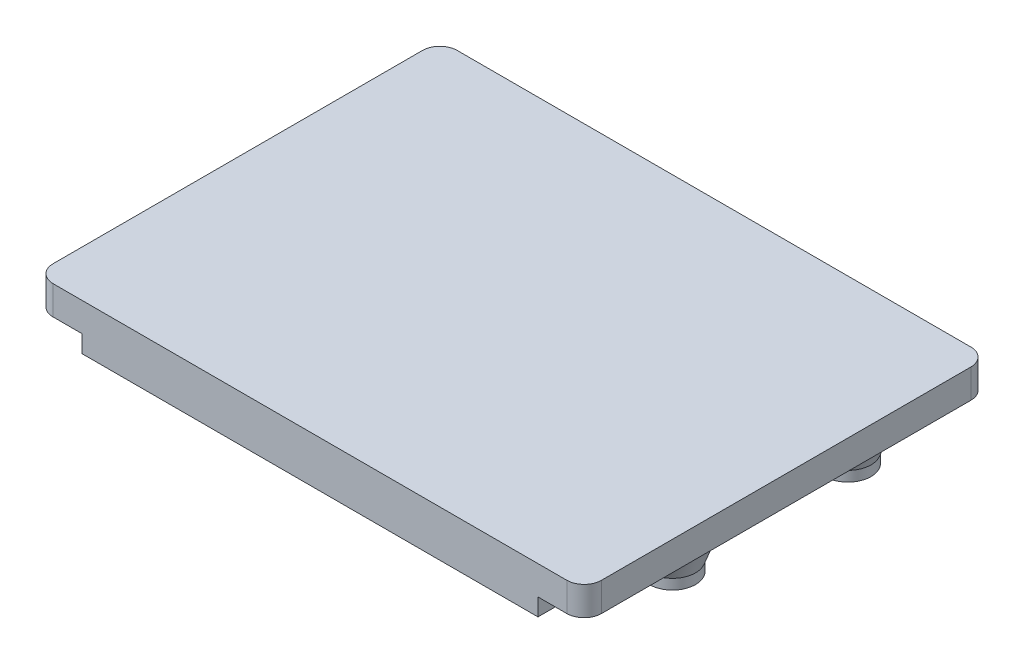
ISO-10303-21;
HEADER;
FILE_DESCRIPTION(('STEP AP214'),'2;1');
FILE_NAME('part.step','',(''),(''),'','','');
FILE_SCHEMA(('AUTOMOTIVE_DESIGN { 1 0 10303 214 1 1 1 1 }'));
ENDSEC;
DATA;
#1=APPLICATION_CONTEXT('core data for automotive mechanical design processes');
#2=APPLICATION_PROTOCOL_DEFINITION('international standard','automotive_design',2000,#1);
#3=PRODUCT_CONTEXT('',#1,'mechanical');
#4=PRODUCT('Part','Part','',(#3));
#5=PRODUCT_RELATED_PRODUCT_CATEGORY('part','',(#4));
#6=PRODUCT_DEFINITION_FORMATION('','',#4);
#7=PRODUCT_DEFINITION_CONTEXT('part definition',#1,'design');
#8=PRODUCT_DEFINITION('design','',#6,#7);
#9=PRODUCT_DEFINITION_SHAPE('','',#8);
#10=(LENGTH_UNIT() NAMED_UNIT(*) SI_UNIT(.MILLI.,.METRE.));
#11=(NAMED_UNIT(*) PLANE_ANGLE_UNIT() SI_UNIT($,.RADIAN.));
#12=(NAMED_UNIT(*) SI_UNIT($,.STERADIAN.) SOLID_ANGLE_UNIT());
#13=UNCERTAINTY_MEASURE_WITH_UNIT(LENGTH_MEASURE(1.E-05),#10,'distance_accuracy_value','');
#14=(GEOMETRIC_REPRESENTATION_CONTEXT(3) GLOBAL_UNCERTAINTY_ASSIGNED_CONTEXT((#13)) GLOBAL_UNIT_ASSIGNED_CONTEXT((#10,
#11,#12)) REPRESENTATION_CONTEXT('',''));
#15=CARTESIAN_POINT('',(0.,0.,0.));
#16=DIRECTION('',(0.,0.,1.));
#17=DIRECTION('',(1.,0.,0.));
#18=AXIS2_PLACEMENT_3D('',#15,#16,#17);
#19=CARTESIAN_POINT('',(-47.5,0.,35.));
#20=DIRECTION('',(0.,1.,0.));
#21=DIRECTION('',(0.,0.,1.));
#22=AXIS2_PLACEMENT_3D('',#19,#20,#21);
#23=PLANE('',#22);
#24=CARTESIAN_POINT('',(-25.5,0.,10.5));
#25=DIRECTION('',(0.,1.,0.));
#26=DIRECTION('',(0.,0.,1.));
#27=AXIS2_PLACEMENT_3D('',#24,#25,#26);
#28=CIRCLE('',#27,7.);
#29=CARTESIAN_POINT('',(-25.5,0.,17.5));
#30=VERTEX_POINT('',#29);
#31=EDGE_CURVE('E403',#30,#30,#28,.T.);
#32=ORIENTED_EDGE('',*,*,#31,.T.);
#33=EDGE_LOOP('',(#32));
#34=FACE_BOUND('',#33,.T.);
#35=CARTESIAN_POINT('',(-36.5,0.,-23.5));
#36=DIRECTION('',(0.,1.,0.));
#37=DIRECTION('',(0.,0.,1.));
#38=AXIS2_PLACEMENT_3D('',#35,#36,#37);
#39=CIRCLE('',#38,7.);
#40=CARTESIAN_POINT('',(-36.5,0.,-16.5));
#41=VERTEX_POINT('',#40);
#42=EDGE_CURVE('E400',#41,#41,#39,.T.);
#43=ORIENTED_EDGE('',*,*,#42,.T.);
#44=EDGE_LOOP('',(#43));
#45=FACE_BOUND('',#44,.T.);
#46=CARTESIAN_POINT('',(36.3,0.,-21.9));
#47=DIRECTION('',(0.,1.,0.));
#48=DIRECTION('',(0.,0.,1.));
#49=AXIS2_PLACEMENT_3D('',#46,#47,#48);
#50=CIRCLE('',#49,7.);
#51=CARTESIAN_POINT('',(36.3,0.,-14.9));
#52=VERTEX_POINT('',#51);
#53=EDGE_CURVE('E397',#52,#52,#50,.T.);
#54=ORIENTED_EDGE('',*,*,#53,.T.);
#55=EDGE_LOOP('',(#54));
#56=FACE_BOUND('',#55,.T.);
#57=CARTESIAN_POINT('',(37.3,0.,9.50000000000001));
#58=DIRECTION('',(0.,1.,0.));
#59=DIRECTION('',(0.,0.,1.));
#60=AXIS2_PLACEMENT_3D('',#57,#58,#59);
#61=CIRCLE('',#60,7.);
#62=CARTESIAN_POINT('',(37.3,0.,16.5));
#63=VERTEX_POINT('',#62);
#64=EDGE_CURVE('E394',#63,#63,#61,.T.);
#65=ORIENTED_EDGE('',*,*,#64,.T.);
#66=EDGE_LOOP('',(#65));
#67=FACE_BOUND('',#66,.T.);
#68=DIRECTION('',(-1.,0.,0.));
#69=VECTOR('',#68,1.);
#70=CARTESIAN_POINT('',(-47.5,0.,-35.));
#71=LINE('',#70,#69);
#72=CARTESIAN_POINT('',(44.5,0.,-35.));
#73=VERTEX_POINT('',#72);
#74=CARTESIAN_POINT('',(29.5,0.,-35.));
#75=VERTEX_POINT('',#74);
#76=EDGE_CURVE('E331',#73,#75,#71,.T.);
#77=ORIENTED_EDGE('',*,*,#76,.F.);
#78=CARTESIAN_POINT('',(44.5,0.,-32.));
#79=DIRECTION('',(0.,1.,0.));
#80=DIRECTION('',(0.,0.,1.));
#81=AXIS2_PLACEMENT_3D('',#78,#79,#80);
#82=CIRCLE('',#81,3.);
#83=CARTESIAN_POINT('',(47.5,0.,-32.));
#84=VERTEX_POINT('',#83);
#85=EDGE_CURVE('E539',#73,#84,#82,.F.);
#86=ORIENTED_EDGE('',*,*,#85,.T.);
#87=DIRECTION('',(0.,0.,-1.));
#88=VECTOR('',#87,1.);
#89=CARTESIAN_POINT('',(47.5,0.,-35.));
#90=LINE('',#89,#88);
#91=CARTESIAN_POINT('',(47.5,0.,32.));
#92=VERTEX_POINT('',#91);
#93=EDGE_CURVE('E319',#92,#84,#90,.T.);
#94=ORIENTED_EDGE('',*,*,#93,.F.);
#95=CARTESIAN_POINT('',(44.5,0.,32.));
#96=DIRECTION('',(0.,1.,0.));
#97=DIRECTION('',(0.,0.,1.));
#98=AXIS2_PLACEMENT_3D('',#95,#96,#97);
#99=CIRCLE('',#98,3.);
#100=CARTESIAN_POINT('',(44.5,0.,35.));
#101=VERTEX_POINT('',#100);
#102=EDGE_CURVE('E315',#92,#101,#99,.F.);
#103=ORIENTED_EDGE('',*,*,#102,.T.);
#104=DIRECTION('',(1.,0.,0.));
#105=VECTOR('',#104,1.);
#106=CARTESIAN_POINT('',(-47.5,0.,35.));
#107=LINE('',#106,#105);
#108=CARTESIAN_POINT('',(39.5,0.,35.));
#109=VERTEX_POINT('',#108);
#110=EDGE_CURVE('E320',#109,#101,#107,.T.);
#111=ORIENTED_EDGE('',*,*,#110,.F.);
#112=DIRECTION('',(0.,0.,1.));
#113=VECTOR('',#112,1.);
#114=CARTESIAN_POINT('',(39.5,0.,35.));
#115=LINE('',#114,#113);
#116=CARTESIAN_POINT('',(39.5,0.,30.));
#117=VERTEX_POINT('',#116);
#118=EDGE_CURVE('E284',#117,#109,#115,.T.);
#119=ORIENTED_EDGE('',*,*,#118,.F.);
#120=DIRECTION('',(1.,0.,0.));
#121=VECTOR('',#120,1.);
#122=CARTESIAN_POINT('',(-39.5,0.,30.));
#123=LINE('',#122,#121);
#124=CARTESIAN_POINT('',(-39.5,0.,30.));
#125=VERTEX_POINT('',#124);
#126=EDGE_CURVE('E291',#125,#117,#123,.T.);
#127=ORIENTED_EDGE('',*,*,#126,.F.);
#128=DIRECTION('',(0.,0.,-1.));
#129=VECTOR('',#128,1.);
#130=CARTESIAN_POINT('',(-39.5,0.,35.));
#131=LINE('',#130,#129);
#132=CARTESIAN_POINT('',(-39.5,0.,35.));
#133=VERTEX_POINT('',#132);
#134=EDGE_CURVE('E279',#133,#125,#131,.T.);
#135=ORIENTED_EDGE('',*,*,#134,.F.);
#136=CARTESIAN_POINT('',(-44.5,0.,35.));
#137=VERTEX_POINT('',#136);
#138=EDGE_CURVE('E316',#137,#133,#107,.T.);
#139=ORIENTED_EDGE('',*,*,#138,.F.);
#140=CARTESIAN_POINT('',(-44.5,0.,32.));
#141=DIRECTION('',(0.,1.,0.));
#142=DIRECTION('',(0.,0.,1.));
#143=AXIS2_PLACEMENT_3D('',#140,#141,#142);
#144=CIRCLE('',#143,3.);
#145=CARTESIAN_POINT('',(-47.5,0.,32.));
#146=VERTEX_POINT('',#145);
#147=EDGE_CURVE('E534',#137,#146,#144,.F.);
#148=ORIENTED_EDGE('',*,*,#147,.T.);
#149=DIRECTION('',(0.,0.,1.));
#150=VECTOR('',#149,1.);
#151=CARTESIAN_POINT('',(-47.5,0.,-35.));
#152=LINE('',#151,#150);
#153=CARTESIAN_POINT('',(-47.5,0.,9.49999999999999));
#154=VERTEX_POINT('',#153);
#155=EDGE_CURVE('E356',#154,#146,#152,.T.);
#156=ORIENTED_EDGE('',*,*,#155,.F.);
#157=DIRECTION('',(-1.,0.,0.));
#158=VECTOR('',#157,1.);
#159=CARTESIAN_POINT('',(-47.5,0.,9.49999999999999));
#160=LINE('',#159,#158);
#161=CARTESIAN_POINT('',(-42.5,0.,9.49999999999999));
#162=VERTEX_POINT('',#161);
#163=EDGE_CURVE('E213',#162,#154,#160,.T.);
#164=ORIENTED_EDGE('',*,*,#163,.F.);
#165=DIRECTION('',(0.,0.,1.));
#166=VECTOR('',#165,1.);
#167=CARTESIAN_POINT('',(-42.5,0.,9.49999999999999));
#168=LINE('',#167,#166);
#169=CARTESIAN_POINT('',(-42.5,0.,0.499999999999995));
#170=VERTEX_POINT('',#169);
#171=EDGE_CURVE('E522',#170,#162,#168,.T.);
#172=ORIENTED_EDGE('',*,*,#171,.F.);
#173=DIRECTION('',(1.,0.,0.));
#174=VECTOR('',#173,1.);
#175=CARTESIAN_POINT('',(-47.5,0.,0.499999999999995));
#176=LINE('',#175,#174);
#177=CARTESIAN_POINT('',(-47.5,0.,0.499999999999995));
#178=VERTEX_POINT('',#177);
#179=EDGE_CURVE('E516',#178,#170,#176,.T.);
#180=ORIENTED_EDGE('',*,*,#179,.F.);
#181=CARTESIAN_POINT('',(-47.5,0.,-5.50000000000001));
#182=VERTEX_POINT('',#181);
#183=EDGE_CURVE('E219',#182,#178,#152,.T.);
#184=ORIENTED_EDGE('',*,*,#183,.F.);
#185=DIRECTION('',(-1.,0.,0.));
#186=VECTOR('',#185,1.);
#187=CARTESIAN_POINT('',(-47.5,0.,-5.50000000000001));
#188=LINE('',#187,#186);
#189=CARTESIAN_POINT('',(-42.5,0.,-5.50000000000001));
#190=VERTEX_POINT('',#189);
#191=EDGE_CURVE('E232',#190,#182,#188,.T.);
#192=ORIENTED_EDGE('',*,*,#191,.F.);
#193=DIRECTION('',(0.,0.,1.));
#194=VECTOR('',#193,1.);
#195=CARTESIAN_POINT('',(-42.5,0.,-5.50000000000001));
#196=LINE('',#195,#194);
#197=CARTESIAN_POINT('',(-42.5,0.,-14.5));
#198=VERTEX_POINT('',#197);
#199=EDGE_CURVE('E222',#198,#190,#196,.T.);
#200=ORIENTED_EDGE('',*,*,#199,.F.);
#201=DIRECTION('',(1.,0.,0.));
#202=VECTOR('',#201,1.);
#203=CARTESIAN_POINT('',(-47.5,0.,-14.5));
#204=LINE('',#203,#202);
#205=CARTESIAN_POINT('',(-47.5,0.,-14.5));
#206=VERTEX_POINT('',#205);
#207=EDGE_CURVE('E220',#206,#198,#204,.T.);
#208=ORIENTED_EDGE('',*,*,#207,.F.);
#209=CARTESIAN_POINT('',(-47.5,0.,-32.));
#210=VERTEX_POINT('',#209);
#211=EDGE_CURVE('E325',#210,#206,#152,.T.);
#212=ORIENTED_EDGE('',*,*,#211,.F.);
#213=CARTESIAN_POINT('',(-44.5,0.,-32.));
#214=DIRECTION('',(0.,1.,0.));
#215=DIRECTION('',(0.,0.,1.));
#216=AXIS2_PLACEMENT_3D('',#213,#214,#215);
#217=CIRCLE('',#216,3.);
#218=CARTESIAN_POINT('',(-44.5,0.,-35.));
#219=VERTEX_POINT('',#218);
#220=EDGE_CURVE('E538',#210,#219,#217,.F.);
#221=ORIENTED_EDGE('',*,*,#220,.T.);
#222=CARTESIAN_POINT('',(-28.5,0.,-35.));
#223=VERTEX_POINT('',#222);
#224=EDGE_CURVE('E673',#223,#219,#71,.T.);
#225=ORIENTED_EDGE('',*,*,#224,.F.);
#226=DIRECTION('',(0.,0.,-1.));
#227=VECTOR('',#226,1.);
#228=CARTESIAN_POINT('',(-28.5,0.,-30.));
#229=LINE('',#228,#227);
#230=CARTESIAN_POINT('',(-28.5,0.,-30.));
#231=VERTEX_POINT('',#230);
#232=EDGE_CURVE('E252',#231,#223,#229,.T.);
#233=ORIENTED_EDGE('',*,*,#232,.F.);
#234=DIRECTION('',(-1.,0.,0.));
#235=VECTOR('',#234,1.);
#236=CARTESIAN_POINT('',(-28.5,0.,-30.));
#237=LINE('',#236,#235);
#238=CARTESIAN_POINT('',(29.5,0.,-30.));
#239=VERTEX_POINT('',#238);
#240=EDGE_CURVE('E257',#239,#231,#237,.T.);
#241=ORIENTED_EDGE('',*,*,#240,.F.);
#242=DIRECTION('',(0.,0.,1.));
#243=VECTOR('',#242,1.);
#244=CARTESIAN_POINT('',(29.5,0.,-30.));
#245=LINE('',#244,#243);
#246=EDGE_CURVE('E265',#75,#239,#245,.T.);
#247=ORIENTED_EDGE('',*,*,#246,.F.);
#248=EDGE_LOOP('',(#77,#86,#94,#103,#111,#119,#127,#135,#139,#148,#156,#164,#172,#180,#184,#192,
#200,#208,#212,#221,#225,#233,#241,#247));
#249=FACE_BOUND('',#248,.T.);
#250=ADVANCED_FACE('F32',(#34,#45,#56,#67,#249),#23,.F.);
#251=CARTESIAN_POINT('',(-47.5,5.,-35.));
#252=DIRECTION('',(1.,0.,0.));
#253=DIRECTION('',(0.,0.,-1.));
#254=AXIS2_PLACEMENT_3D('',#251,#252,#253);
#255=PLANE('',#254);
#256=DIRECTION('',(0.,0.,1.));
#257=VECTOR('',#256,1.);
#258=CARTESIAN_POINT('',(-47.5,5.,-35.));
#259=LINE('',#258,#257);
#260=CARTESIAN_POINT('',(-47.5,5.,-32.));
#261=VERTEX_POINT('',#260);
#262=CARTESIAN_POINT('',(-47.5,5.,32.));
#263=VERTEX_POINT('',#262);
#264=EDGE_CURVE('E359',#261,#263,#259,.T.);
#265=ORIENTED_EDGE('',*,*,#264,.F.);
#266=DIRECTION('',(0.,-1.,0.));
#267=VECTOR('',#266,1.);
#268=CARTESIAN_POINT('',(-47.5,5.,-32.));
#269=LINE('',#268,#267);
#270=EDGE_CURVE('E379',#261,#210,#269,.T.);
#271=ORIENTED_EDGE('',*,*,#270,.T.);
#272=ORIENTED_EDGE('',*,*,#211,.T.);
#273=DIRECTION('',(0.,1.,0.));
#274=VECTOR('',#273,1.);
#275=CARTESIAN_POINT('',(-47.5,-3.,-14.5));
#276=LINE('',#275,#274);
#277=CARTESIAN_POINT('',(-47.5,-3.,-14.5));
#278=VERTEX_POINT('',#277);
#279=EDGE_CURVE('E249',#278,#206,#276,.T.);
#280=ORIENTED_EDGE('',*,*,#279,.F.);
#281=DIRECTION('',(0.,0.,-1.));
#282=VECTOR('',#281,1.);
#283=CARTESIAN_POINT('',(-47.5,-3.,-5.50000000000001));
#284=LINE('',#283,#282);
#285=CARTESIAN_POINT('',(-47.5,-3.,-5.50000000000001));
#286=VERTEX_POINT('',#285);
#287=EDGE_CURVE('E228',#286,#278,#284,.T.);
#288=ORIENTED_EDGE('',*,*,#287,.F.);
#289=DIRECTION('',(0.,1.,0.));
#290=VECTOR('',#289,1.);
#291=CARTESIAN_POINT('',(-47.5,-3.,-5.50000000000001));
#292=LINE('',#291,#290);
#293=EDGE_CURVE('E237',#286,#182,#292,.T.);
#294=ORIENTED_EDGE('',*,*,#293,.T.);
#295=ORIENTED_EDGE('',*,*,#183,.T.);
#296=DIRECTION('',(0.,1.,0.));
#297=VECTOR('',#296,1.);
#298=CARTESIAN_POINT('',(-47.5,-5.,0.499999999999995));
#299=LINE('',#298,#297);
#300=CARTESIAN_POINT('',(-47.5,-5.,0.499999999999995));
#301=VERTEX_POINT('',#300);
#302=EDGE_CURVE('E198',#301,#178,#299,.T.);
#303=ORIENTED_EDGE('',*,*,#302,.F.);
#304=DIRECTION('',(0.,0.,-1.));
#305=VECTOR('',#304,1.);
#306=CARTESIAN_POINT('',(-47.5,-5.,9.49999999999999));
#307=LINE('',#306,#305);
#308=CARTESIAN_POINT('',(-47.5,-5.,9.49999999999999));
#309=VERTEX_POINT('',#308);
#310=EDGE_CURVE('E205',#309,#301,#307,.T.);
#311=ORIENTED_EDGE('',*,*,#310,.F.);
#312=DIRECTION('',(0.,1.,0.));
#313=VECTOR('',#312,1.);
#314=CARTESIAN_POINT('',(-47.5,-5.,9.49999999999999));
#315=LINE('',#314,#313);
#316=EDGE_CURVE('E520',#309,#154,#315,.T.);
#317=ORIENTED_EDGE('',*,*,#316,.T.);
#318=ORIENTED_EDGE('',*,*,#155,.T.);
#319=DIRECTION('',(0.,-1.,0.));
#320=VECTOR('',#319,1.);
#321=CARTESIAN_POINT('',(-47.5,5.,32.));
#322=LINE('',#321,#320);
#323=EDGE_CURVE('E381',#146,#263,#322,.F.);
#324=ORIENTED_EDGE('',*,*,#323,.T.);
#325=EDGE_LOOP('',(#265,#271,#272,#280,#288,#294,#295,#303,#311,#317,#318,#324));
#326=FACE_BOUND('',#325,.T.);
#327=ADVANCED_FACE('F217',(#326),#255,.F.);
#328=CARTESIAN_POINT('',(-47.5,5.,35.));
#329=DIRECTION('',(0.,0.,-1.));
#330=DIRECTION('',(-1.,0.,0.));
#331=AXIS2_PLACEMENT_3D('',#328,#329,#330);
#332=PLANE('',#331);
#333=DIRECTION('',(1.,0.,0.));
#334=VECTOR('',#333,1.);
#335=CARTESIAN_POINT('',(-47.5,5.,35.));
#336=LINE('',#335,#334);
#337=CARTESIAN_POINT('',(-44.5,5.,35.));
#338=VERTEX_POINT('',#337);
#339=CARTESIAN_POINT('',(44.5,5.,35.));
#340=VERTEX_POINT('',#339);
#341=EDGE_CURVE('E361',#338,#340,#336,.T.);
#342=ORIENTED_EDGE('',*,*,#341,.F.);
#343=DIRECTION('',(0.,-1.,0.));
#344=VECTOR('',#343,1.);
#345=CARTESIAN_POINT('',(-44.5,5.,35.));
#346=LINE('',#345,#344);
#347=EDGE_CURVE('E347',#338,#137,#346,.T.);
#348=ORIENTED_EDGE('',*,*,#347,.T.);
#349=ORIENTED_EDGE('',*,*,#138,.T.);
#350=DIRECTION('',(0.,1.,0.));
#351=VECTOR('',#350,1.);
#352=CARTESIAN_POINT('',(-39.5,-3.,35.));
#353=LINE('',#352,#351);
#354=CARTESIAN_POINT('',(-39.5,-3.,35.));
#355=VERTEX_POINT('',#354);
#356=EDGE_CURVE('E290',#355,#133,#353,.T.);
#357=ORIENTED_EDGE('',*,*,#356,.F.);
#358=DIRECTION('',(-1.,0.,0.));
#359=VECTOR('',#358,1.);
#360=CARTESIAN_POINT('',(-39.5,-3.,35.));
#361=LINE('',#360,#359);
#362=CARTESIAN_POINT('',(39.5,-3.,35.));
#363=VERTEX_POINT('',#362);
#364=EDGE_CURVE('E288',#363,#355,#361,.T.);
#365=ORIENTED_EDGE('',*,*,#364,.F.);
#366=DIRECTION('',(0.,1.,0.));
#367=VECTOR('',#366,1.);
#368=CARTESIAN_POINT('',(39.5,-3.,35.));
#369=LINE('',#368,#367);
#370=EDGE_CURVE('E304',#363,#109,#369,.T.);
#371=ORIENTED_EDGE('',*,*,#370,.T.);
#372=ORIENTED_EDGE('',*,*,#110,.T.);
#373=DIRECTION('',(0.,-1.,0.));
#374=VECTOR('',#373,1.);
#375=CARTESIAN_POINT('',(44.5,5.,35.));
#376=LINE('',#375,#374);
#377=EDGE_CURVE('E47',#101,#340,#376,.F.);
#378=ORIENTED_EDGE('',*,*,#377,.T.);
#379=EDGE_LOOP('',(#342,#348,#349,#357,#365,#371,#372,#378));
#380=FACE_BOUND('',#379,.T.);
#381=ADVANCED_FACE('F343',(#380),#332,.F.);
#382=CARTESIAN_POINT('',(47.5,5.,-35.));
#383=DIRECTION('',(-1.,0.,0.));
#384=DIRECTION('',(0.,0.,1.));
#385=AXIS2_PLACEMENT_3D('',#382,#383,#384);
#386=PLANE('',#385);
#387=ORIENTED_EDGE('',*,*,#93,.T.);
#388=DIRECTION('',(0.,-1.,0.));
#389=VECTOR('',#388,1.);
#390=CARTESIAN_POINT('',(47.5,5.,-32.));
#391=LINE('',#390,#389);
#392=CARTESIAN_POINT('',(47.5,5.,-32.));
#393=VERTEX_POINT('',#392);
#394=EDGE_CURVE('E546',#84,#393,#391,.F.);
#395=ORIENTED_EDGE('',*,*,#394,.T.);
#396=DIRECTION('',(0.,0.,-1.));
#397=VECTOR('',#396,1.);
#398=CARTESIAN_POINT('',(47.5,5.,-35.));
#399=LINE('',#398,#397);
#400=CARTESIAN_POINT('',(47.5,5.,32.));
#401=VERTEX_POINT('',#400);
#402=EDGE_CURVE('E363',#401,#393,#399,.T.);
#403=ORIENTED_EDGE('',*,*,#402,.F.);
#404=DIRECTION('',(0.,-1.,0.));
#405=VECTOR('',#404,1.);
#406=CARTESIAN_POINT('',(47.5,5.,32.));
#407=LINE('',#406,#405);
#408=EDGE_CURVE('E543',#401,#92,#407,.T.);
#409=ORIENTED_EDGE('',*,*,#408,.T.);
#410=EDGE_LOOP('',(#387,#395,#403,#409));
#411=FACE_BOUND('',#410,.T.);
#412=ADVANCED_FACE('F553',(#411),#386,.F.);
#413=CARTESIAN_POINT('',(-47.5,5.,-35.));
#414=DIRECTION('',(0.,0.,1.));
#415=DIRECTION('',(1.,0.,0.));
#416=AXIS2_PLACEMENT_3D('',#413,#414,#415);
#417=PLANE('',#416);
#418=DIRECTION('',(-1.,0.,0.));
#419=VECTOR('',#418,1.);
#420=CARTESIAN_POINT('',(-47.5,5.,-35.));
#421=LINE('',#420,#419);
#422=CARTESIAN_POINT('',(44.5,5.,-35.));
#423=VERTEX_POINT('',#422);
#424=CARTESIAN_POINT('',(-44.5,5.,-35.));
#425=VERTEX_POINT('',#424);
#426=EDGE_CURVE('E312',#423,#425,#421,.T.);
#427=ORIENTED_EDGE('',*,*,#426,.F.);
#428=DIRECTION('',(0.,-1.,0.));
#429=VECTOR('',#428,1.);
#430=CARTESIAN_POINT('',(44.5,5.,-35.));
#431=LINE('',#430,#429);
#432=EDGE_CURVE('E311',#423,#73,#431,.T.);
#433=ORIENTED_EDGE('',*,*,#432,.T.);
#434=ORIENTED_EDGE('',*,*,#76,.T.);
#435=DIRECTION('',(0.,1.,0.));
#436=VECTOR('',#435,1.);
#437=CARTESIAN_POINT('',(29.5,-3.,-35.));
#438=LINE('',#437,#436);
#439=CARTESIAN_POINT('',(29.5,-3.,-35.));
#440=VERTEX_POINT('',#439);
#441=EDGE_CURVE('E273',#440,#75,#438,.T.);
#442=ORIENTED_EDGE('',*,*,#441,.F.);
#443=DIRECTION('',(1.,0.,0.));
#444=VECTOR('',#443,1.);
#445=CARTESIAN_POINT('',(-28.5,-3.,-35.));
#446=LINE('',#445,#444);
#447=CARTESIAN_POINT('',(-28.5,-3.,-35.));
#448=VERTEX_POINT('',#447);
#449=EDGE_CURVE('E256',#448,#440,#446,.T.);
#450=ORIENTED_EDGE('',*,*,#449,.F.);
#451=DIRECTION('',(0.,1.,0.));
#452=VECTOR('',#451,1.);
#453=CARTESIAN_POINT('',(-28.5,-3.,-35.));
#454=LINE('',#453,#452);
#455=EDGE_CURVE('E276',#448,#223,#454,.T.);
#456=ORIENTED_EDGE('',*,*,#455,.T.);
#457=ORIENTED_EDGE('',*,*,#224,.T.);
#458=DIRECTION('',(0.,-1.,0.));
#459=VECTOR('',#458,1.);
#460=CARTESIAN_POINT('',(-44.5,5.,-35.));
#461=LINE('',#460,#459);
#462=EDGE_CURVE('E309',#219,#425,#461,.F.);
#463=ORIENTED_EDGE('',*,*,#462,.T.);
#464=EDGE_LOOP('',(#427,#433,#434,#442,#450,#456,#457,#463));
#465=FACE_BOUND('',#464,.T.);
#466=ADVANCED_FACE('F580',(#465),#417,.F.);
#467=CARTESIAN_POINT('',(-47.5,5.,35.));
#468=DIRECTION('',(0.,1.,0.));
#469=DIRECTION('',(0.,0.,1.));
#470=AXIS2_PLACEMENT_3D('',#467,#468,#469);
#471=PLANE('',#470);
#472=ORIENTED_EDGE('',*,*,#402,.T.);
#473=CARTESIAN_POINT('',(44.5,5.,-32.));
#474=DIRECTION('',(0.,1.,0.));
#475=DIRECTION('',(0.,0.,1.));
#476=AXIS2_PLACEMENT_3D('',#473,#474,#475);
#477=CIRCLE('',#476,3.);
#478=EDGE_CURVE('E371',#393,#423,#477,.T.);
#479=ORIENTED_EDGE('',*,*,#478,.T.);
#480=ORIENTED_EDGE('',*,*,#426,.T.);
#481=CARTESIAN_POINT('',(-44.5,5.,-32.));
#482=DIRECTION('',(0.,1.,0.));
#483=DIRECTION('',(0.,0.,1.));
#484=AXIS2_PLACEMENT_3D('',#481,#482,#483);
#485=CIRCLE('',#484,3.);
#486=EDGE_CURVE('E369',#425,#261,#485,.T.);
#487=ORIENTED_EDGE('',*,*,#486,.T.);
#488=ORIENTED_EDGE('',*,*,#264,.T.);
#489=CARTESIAN_POINT('',(-44.5,5.,32.));
#490=DIRECTION('',(0.,1.,0.));
#491=DIRECTION('',(0.,0.,1.));
#492=AXIS2_PLACEMENT_3D('',#489,#490,#491);
#493=CIRCLE('',#492,3.);
#494=EDGE_CURVE('E54',#263,#338,#493,.T.);
#495=ORIENTED_EDGE('',*,*,#494,.T.);
#496=ORIENTED_EDGE('',*,*,#341,.T.);
#497=CARTESIAN_POINT('',(44.5,5.,32.));
#498=DIRECTION('',(0.,1.,0.));
#499=DIRECTION('',(0.,0.,1.));
#500=AXIS2_PLACEMENT_3D('',#497,#498,#499);
#501=CIRCLE('',#500,3.);
#502=EDGE_CURVE('E383',#340,#401,#501,.T.);
#503=ORIENTED_EDGE('',*,*,#502,.T.);
#504=EDGE_LOOP('',(#472,#479,#480,#487,#488,#495,#496,#503));
#505=FACE_BOUND('',#504,.T.);
#506=ADVANCED_FACE('F368',(#505),#471,.T.);
#507=CARTESIAN_POINT('',(-39.5,-3.,35.));
#508=DIRECTION('',(1.,0.,0.));
#509=DIRECTION('',(0.,0.,-1.));
#510=AXIS2_PLACEMENT_3D('',#507,#508,#509);
#511=PLANE('',#510);
#512=ORIENTED_EDGE('',*,*,#134,.T.);
#513=DIRECTION('',(0.,1.,0.));
#514=VECTOR('',#513,1.);
#515=CARTESIAN_POINT('',(-39.5,-3.,30.));
#516=LINE('',#515,#514);
#517=CARTESIAN_POINT('',(-39.5,-3.,30.));
#518=VERTEX_POINT('',#517);
#519=EDGE_CURVE('E354',#518,#125,#516,.T.);
#520=ORIENTED_EDGE('',*,*,#519,.F.);
#521=DIRECTION('',(0.,0.,-1.));
#522=VECTOR('',#521,1.);
#523=CARTESIAN_POINT('',(-39.5,-3.,35.));
#524=LINE('',#523,#522);
#525=EDGE_CURVE('E280',#355,#518,#524,.T.);
#526=ORIENTED_EDGE('',*,*,#525,.F.);
#527=ORIENTED_EDGE('',*,*,#356,.T.);
#528=EDGE_LOOP('',(#512,#520,#526,#527));
#529=FACE_BOUND('',#528,.T.);
#530=ADVANCED_FACE('F339',(#529),#511,.F.);
#531=CARTESIAN_POINT('',(-39.5,-3.,30.));
#532=DIRECTION('',(0.,0.,1.));
#533=DIRECTION('',(1.,0.,0.));
#534=AXIS2_PLACEMENT_3D('',#531,#532,#533);
#535=PLANE('',#534);
#536=ORIENTED_EDGE('',*,*,#126,.T.);
#537=DIRECTION('',(0.,1.,0.));
#538=VECTOR('',#537,1.);
#539=CARTESIAN_POINT('',(39.5,-3.,30.));
#540=LINE('',#539,#538);
#541=CARTESIAN_POINT('',(39.5,-3.,30.));
#542=VERTEX_POINT('',#541);
#543=EDGE_CURVE('E296',#542,#117,#540,.T.);
#544=ORIENTED_EDGE('',*,*,#543,.F.);
#545=DIRECTION('',(1.,0.,0.));
#546=VECTOR('',#545,1.);
#547=CARTESIAN_POINT('',(-39.5,-3.,30.));
#548=LINE('',#547,#546);
#549=EDGE_CURVE('E283',#518,#542,#548,.T.);
#550=ORIENTED_EDGE('',*,*,#549,.F.);
#551=ORIENTED_EDGE('',*,*,#519,.T.);
#552=EDGE_LOOP('',(#536,#544,#550,#551));
#553=FACE_BOUND('',#552,.T.);
#554=ADVANCED_FACE('F355',(#553),#535,.F.);
#555=CARTESIAN_POINT('',(39.5,-3.,35.));
#556=DIRECTION('',(-1.,0.,0.));
#557=DIRECTION('',(0.,0.,1.));
#558=AXIS2_PLACEMENT_3D('',#555,#556,#557);
#559=PLANE('',#558);
#560=ORIENTED_EDGE('',*,*,#118,.T.);
#561=ORIENTED_EDGE('',*,*,#370,.F.);
#562=DIRECTION('',(0.,0.,1.));
#563=VECTOR('',#562,1.);
#564=CARTESIAN_POINT('',(39.5,-3.,35.));
#565=LINE('',#564,#563);
#566=EDGE_CURVE('E286',#542,#363,#565,.T.);
#567=ORIENTED_EDGE('',*,*,#566,.F.);
#568=ORIENTED_EDGE('',*,*,#543,.T.);
#569=EDGE_LOOP('',(#560,#561,#567,#568));
#570=FACE_BOUND('',#569,.T.);
#571=ADVANCED_FACE('F560',(#570),#559,.F.);
#572=CARTESIAN_POINT('',(-39.5,-3.,30.));
#573=DIRECTION('',(0.,-1.,0.));
#574=DIRECTION('',(0.,0.,-1.));
#575=AXIS2_PLACEMENT_3D('',#572,#573,#574);
#576=PLANE('',#575);
#577=ORIENTED_EDGE('',*,*,#525,.T.);
#578=ORIENTED_EDGE('',*,*,#549,.T.);
#579=ORIENTED_EDGE('',*,*,#566,.T.);
#580=ORIENTED_EDGE('',*,*,#364,.T.);
#581=EDGE_LOOP('',(#577,#578,#579,#580));
#582=FACE_BOUND('',#581,.T.);
#583=ADVANCED_FACE('F562',(#582),#576,.T.);
#584=CARTESIAN_POINT('',(-28.5,-3.,-30.));
#585=DIRECTION('',(1.,0.,0.));
#586=DIRECTION('',(0.,0.,-1.));
#587=AXIS2_PLACEMENT_3D('',#584,#585,#586);
#588=PLANE('',#587);
#589=ORIENTED_EDGE('',*,*,#232,.T.);
#590=ORIENTED_EDGE('',*,*,#455,.F.);
#591=DIRECTION('',(0.,0.,-1.));
#592=VECTOR('',#591,1.);
#593=CARTESIAN_POINT('',(-28.5,-3.,-30.));
#594=LINE('',#593,#592);
#595=CARTESIAN_POINT('',(-28.5,-3.,-30.));
#596=VERTEX_POINT('',#595);
#597=EDGE_CURVE('E253',#596,#448,#594,.T.);
#598=ORIENTED_EDGE('',*,*,#597,.F.);
#599=DIRECTION('',(0.,1.,0.));
#600=VECTOR('',#599,1.);
#601=CARTESIAN_POINT('',(-28.5,-3.,-30.));
#602=LINE('',#601,#600);
#603=EDGE_CURVE('E263',#596,#231,#602,.T.);
#604=ORIENTED_EDGE('',*,*,#603,.T.);
#605=EDGE_LOOP('',(#589,#590,#598,#604));
#606=FACE_BOUND('',#605,.T.);
#607=ADVANCED_FACE('F564',(#606),#588,.F.);
#608=CARTESIAN_POINT('',(29.5,-3.,-30.));
#609=DIRECTION('',(-1.,0.,0.));
#610=DIRECTION('',(0.,0.,1.));
#611=AXIS2_PLACEMENT_3D('',#608,#609,#610);
#612=PLANE('',#611);
#613=ORIENTED_EDGE('',*,*,#246,.T.);
#614=DIRECTION('',(0.,1.,0.));
#615=VECTOR('',#614,1.);
#616=CARTESIAN_POINT('',(29.5,-3.,-30.));
#617=LINE('',#616,#615);
#618=CARTESIAN_POINT('',(29.5,-3.,-30.));
#619=VERTEX_POINT('',#618);
#620=EDGE_CURVE('E270',#619,#239,#617,.T.);
#621=ORIENTED_EDGE('',*,*,#620,.F.);
#622=DIRECTION('',(0.,0.,1.));
#623=VECTOR('',#622,1.);
#624=CARTESIAN_POINT('',(29.5,-3.,-30.));
#625=LINE('',#624,#623);
#626=EDGE_CURVE('E259',#440,#619,#625,.T.);
#627=ORIENTED_EDGE('',*,*,#626,.F.);
#628=ORIENTED_EDGE('',*,*,#441,.T.);
#629=EDGE_LOOP('',(#613,#621,#627,#628));
#630=FACE_BOUND('',#629,.T.);
#631=ADVANCED_FACE('F570',(#630),#612,.F.);
#632=CARTESIAN_POINT('',(-28.5,-3.,-30.));
#633=DIRECTION('',(0.,0.,-1.));
#634=DIRECTION('',(-1.,0.,0.));
#635=AXIS2_PLACEMENT_3D('',#632,#633,#634);
#636=PLANE('',#635);
#637=ORIENTED_EDGE('',*,*,#240,.T.);
#638=ORIENTED_EDGE('',*,*,#603,.F.);
#639=DIRECTION('',(-1.,0.,0.));
#640=VECTOR('',#639,1.);
#641=CARTESIAN_POINT('',(-28.5,-3.,-30.));
#642=LINE('',#641,#640);
#643=EDGE_CURVE('E261',#619,#596,#642,.T.);
#644=ORIENTED_EDGE('',*,*,#643,.F.);
#645=ORIENTED_EDGE('',*,*,#620,.T.);
#646=EDGE_LOOP('',(#637,#638,#644,#645));
#647=FACE_BOUND('',#646,.T.);
#648=ADVANCED_FACE('F655',(#647),#636,.F.);
#649=CARTESIAN_POINT('',(-28.5,-3.,-35.));
#650=DIRECTION('',(0.,-1.,0.));
#651=DIRECTION('',(0.,0.,-1.));
#652=AXIS2_PLACEMENT_3D('',#649,#650,#651);
#653=PLANE('',#652);
#654=ORIENTED_EDGE('',*,*,#597,.T.);
#655=ORIENTED_EDGE('',*,*,#449,.T.);
#656=ORIENTED_EDGE('',*,*,#626,.T.);
#657=ORIENTED_EDGE('',*,*,#643,.T.);
#658=EDGE_LOOP('',(#654,#655,#656,#657));
#659=FACE_BOUND('',#658,.T.);
#660=ADVANCED_FACE('F651',(#659),#653,.T.);
#661=CARTESIAN_POINT('',(-47.5,-3.,-14.5));
#662=DIRECTION('',(0.,0.,1.));
#663=DIRECTION('',(1.,0.,0.));
#664=AXIS2_PLACEMENT_3D('',#661,#662,#663);
#665=PLANE('',#664);
#666=ORIENTED_EDGE('',*,*,#207,.T.);
#667=DIRECTION('',(0.,1.,0.));
#668=VECTOR('',#667,1.);
#669=CARTESIAN_POINT('',(-42.5,-3.,-14.5));
#670=LINE('',#669,#668);
#671=CARTESIAN_POINT('',(-42.5,-3.,-14.5));
#672=VERTEX_POINT('',#671);
#673=EDGE_CURVE('E246',#672,#198,#670,.T.);
#674=ORIENTED_EDGE('',*,*,#673,.F.);
#675=DIRECTION('',(1.,0.,0.));
#676=VECTOR('',#675,1.);
#677=CARTESIAN_POINT('',(-47.5,-3.,-14.5));
#678=LINE('',#677,#676);
#679=EDGE_CURVE('E231',#278,#672,#678,.T.);
#680=ORIENTED_EDGE('',*,*,#679,.F.);
#681=ORIENTED_EDGE('',*,*,#279,.T.);
#682=EDGE_LOOP('',(#666,#674,#680,#681));
#683=FACE_BOUND('',#682,.T.);
#684=ADVANCED_FACE('F647',(#683),#665,.F.);
#685=CARTESIAN_POINT('',(-42.5,-3.,-5.50000000000001));
#686=DIRECTION('',(-1.,0.,0.));
#687=DIRECTION('',(0.,0.,1.));
#688=AXIS2_PLACEMENT_3D('',#685,#686,#687);
#689=PLANE('',#688);
#690=ORIENTED_EDGE('',*,*,#199,.T.);
#691=DIRECTION('',(0.,1.,0.));
#692=VECTOR('',#691,1.);
#693=CARTESIAN_POINT('',(-42.5,-3.,-5.50000000000001));
#694=LINE('',#693,#692);
#695=CARTESIAN_POINT('',(-42.5,-3.,-5.50000000000001));
#696=VERTEX_POINT('',#695);
#697=EDGE_CURVE('E243',#696,#190,#694,.T.);
#698=ORIENTED_EDGE('',*,*,#697,.F.);
#699=DIRECTION('',(0.,0.,1.));
#700=VECTOR('',#699,1.);
#701=CARTESIAN_POINT('',(-42.5,-3.,-5.50000000000001));
#702=LINE('',#701,#700);
#703=EDGE_CURVE('E234',#672,#696,#702,.T.);
#704=ORIENTED_EDGE('',*,*,#703,.F.);
#705=ORIENTED_EDGE('',*,*,#673,.T.);
#706=EDGE_LOOP('',(#690,#698,#704,#705));
#707=FACE_BOUND('',#706,.T.);
#708=ADVANCED_FACE('F643',(#707),#689,.F.);
#709=CARTESIAN_POINT('',(-47.5,-3.,-5.50000000000001));
#710=DIRECTION('',(0.,0.,-1.));
#711=DIRECTION('',(-1.,0.,0.));
#712=AXIS2_PLACEMENT_3D('',#709,#710,#711);
#713=PLANE('',#712);
#714=ORIENTED_EDGE('',*,*,#191,.T.);
#715=ORIENTED_EDGE('',*,*,#293,.F.);
#716=DIRECTION('',(-1.,0.,0.));
#717=VECTOR('',#716,1.);
#718=CARTESIAN_POINT('',(-47.5,-3.,-5.50000000000001));
#719=LINE('',#718,#717);
#720=EDGE_CURVE('E236',#696,#286,#719,.T.);
#721=ORIENTED_EDGE('',*,*,#720,.F.);
#722=ORIENTED_EDGE('',*,*,#697,.T.);
#723=EDGE_LOOP('',(#714,#715,#721,#722));
#724=FACE_BOUND('',#723,.T.);
#725=ADVANCED_FACE('F639',(#724),#713,.F.);
#726=CARTESIAN_POINT('',(-47.5,-3.,-14.5));
#727=DIRECTION('',(0.,-1.,0.));
#728=DIRECTION('',(0.,0.,-1.));
#729=AXIS2_PLACEMENT_3D('',#726,#727,#728);
#730=PLANE('',#729);
#731=ORIENTED_EDGE('',*,*,#287,.T.);
#732=ORIENTED_EDGE('',*,*,#679,.T.);
#733=ORIENTED_EDGE('',*,*,#703,.T.);
#734=ORIENTED_EDGE('',*,*,#720,.T.);
#735=EDGE_LOOP('',(#731,#732,#733,#734));
#736=FACE_BOUND('',#735,.T.);
#737=ADVANCED_FACE('F636',(#736),#730,.T.);
#738=CARTESIAN_POINT('',(-47.5,-5.,0.499999999999995));
#739=DIRECTION('',(0.,0.,1.));
#740=DIRECTION('',(1.,0.,0.));
#741=AXIS2_PLACEMENT_3D('',#738,#739,#740);
#742=PLANE('',#741);
#743=ORIENTED_EDGE('',*,*,#179,.T.);
#744=DIRECTION('',(0.,1.,0.));
#745=VECTOR('',#744,1.);
#746=CARTESIAN_POINT('',(-42.5,-5.,0.499999999999995));
#747=LINE('',#746,#745);
#748=CARTESIAN_POINT('',(-42.5,-5.,0.499999999999995));
#749=VERTEX_POINT('',#748);
#750=EDGE_CURVE('E201',#749,#170,#747,.T.);
#751=ORIENTED_EDGE('',*,*,#750,.F.);
#752=DIRECTION('',(1.,0.,0.));
#753=VECTOR('',#752,1.);
#754=CARTESIAN_POINT('',(-47.5,-5.,0.499999999999995));
#755=LINE('',#754,#753);
#756=EDGE_CURVE('E194',#301,#749,#755,.T.);
#757=ORIENTED_EDGE('',*,*,#756,.F.);
#758=ORIENTED_EDGE('',*,*,#302,.T.);
#759=EDGE_LOOP('',(#743,#751,#757,#758));
#760=FACE_BOUND('',#759,.T.);
#761=ADVANCED_FACE('F196',(#760),#742,.F.);
#762=CARTESIAN_POINT('',(-42.5,-5.,9.49999999999999));
#763=DIRECTION('',(-1.,0.,0.));
#764=DIRECTION('',(0.,0.,1.));
#765=AXIS2_PLACEMENT_3D('',#762,#763,#764);
#766=PLANE('',#765);
#767=ORIENTED_EDGE('',*,*,#171,.T.);
#768=DIRECTION('',(0.,1.,0.));
#769=VECTOR('',#768,1.);
#770=CARTESIAN_POINT('',(-42.5,-5.,9.49999999999999));
#771=LINE('',#770,#769);
#772=CARTESIAN_POINT('',(-42.5,-5.,9.49999999999999));
#773=VERTEX_POINT('',#772);
#774=EDGE_CURVE('E224',#773,#162,#771,.T.);
#775=ORIENTED_EDGE('',*,*,#774,.F.);
#776=DIRECTION('',(0.,0.,1.));
#777=VECTOR('',#776,1.);
#778=CARTESIAN_POINT('',(-42.5,-5.,9.49999999999999));
#779=LINE('',#778,#777);
#780=EDGE_CURVE('E204',#749,#773,#779,.T.);
#781=ORIENTED_EDGE('',*,*,#780,.F.);
#782=ORIENTED_EDGE('',*,*,#750,.T.);
#783=EDGE_LOOP('',(#767,#775,#781,#782));
#784=FACE_BOUND('',#783,.T.);
#785=ADVANCED_FACE('F631',(#784),#766,.F.);
#786=CARTESIAN_POINT('',(-47.5,-5.,9.49999999999999));
#787=DIRECTION('',(0.,0.,-1.));
#788=DIRECTION('',(-1.,0.,0.));
#789=AXIS2_PLACEMENT_3D('',#786,#787,#788);
#790=PLANE('',#789);
#791=ORIENTED_EDGE('',*,*,#163,.T.);
#792=ORIENTED_EDGE('',*,*,#316,.F.);
#793=DIRECTION('',(-1.,0.,0.));
#794=VECTOR('',#793,1.);
#795=CARTESIAN_POINT('',(-47.5,-5.,9.49999999999999));
#796=LINE('',#795,#794);
#797=EDGE_CURVE('E210',#773,#309,#796,.T.);
#798=ORIENTED_EDGE('',*,*,#797,.F.);
#799=ORIENTED_EDGE('',*,*,#774,.T.);
#800=EDGE_LOOP('',(#791,#792,#798,#799));
#801=FACE_BOUND('',#800,.T.);
#802=ADVANCED_FACE('F530',(#801),#790,.F.);
#803=CARTESIAN_POINT('',(-47.5,-5.,0.499999999999995));
#804=DIRECTION('',(0.,-1.,0.));
#805=DIRECTION('',(0.,0.,-1.));
#806=AXIS2_PLACEMENT_3D('',#803,#804,#805);
#807=PLANE('',#806);
#808=ORIENTED_EDGE('',*,*,#310,.T.);
#809=ORIENTED_EDGE('',*,*,#756,.T.);
#810=ORIENTED_EDGE('',*,*,#780,.T.);
#811=ORIENTED_EDGE('',*,*,#797,.T.);
#812=EDGE_LOOP('',(#808,#809,#810,#811));
#813=FACE_BOUND('',#812,.T.);
#814=ADVANCED_FACE('F208',(#813),#807,.T.);
#815=CARTESIAN_POINT('',(44.5,5.,-32.));
#816=DIRECTION('',(0.,-1.,0.));
#817=DIRECTION('',(0.,0.,-1.));
#818=AXIS2_PLACEMENT_3D('',#815,#816,#817);
#819=CYLINDRICAL_SURFACE('',#818,3.);
#820=ORIENTED_EDGE('',*,*,#478,.F.);
#821=ORIENTED_EDGE('',*,*,#394,.F.);
#822=ORIENTED_EDGE('',*,*,#85,.F.);
#823=ORIENTED_EDGE('',*,*,#432,.F.);
#824=EDGE_LOOP('',(#820,#821,#822,#823));
#825=FACE_BOUND('',#824,.T.);
#826=ADVANCED_FACE('F591',(#825),#819,.T.);
#827=CARTESIAN_POINT('',(-44.5,5.,-32.));
#828=DIRECTION('',(0.,-1.,0.));
#829=DIRECTION('',(0.,0.,-1.));
#830=AXIS2_PLACEMENT_3D('',#827,#828,#829);
#831=CYLINDRICAL_SURFACE('',#830,3.);
#832=ORIENTED_EDGE('',*,*,#486,.F.);
#833=ORIENTED_EDGE('',*,*,#462,.F.);
#834=ORIENTED_EDGE('',*,*,#220,.F.);
#835=ORIENTED_EDGE('',*,*,#270,.F.);
#836=EDGE_LOOP('',(#832,#833,#834,#835));
#837=FACE_BOUND('',#836,.T.);
#838=ADVANCED_FACE('F377',(#837),#831,.T.);
#839=CARTESIAN_POINT('',(-44.5,5.,32.));
#840=DIRECTION('',(0.,-1.,0.));
#841=DIRECTION('',(0.,0.,-1.));
#842=AXIS2_PLACEMENT_3D('',#839,#840,#841);
#843=CYLINDRICAL_SURFACE('',#842,3.);
#844=ORIENTED_EDGE('',*,*,#494,.F.);
#845=ORIENTED_EDGE('',*,*,#323,.F.);
#846=ORIENTED_EDGE('',*,*,#147,.F.);
#847=ORIENTED_EDGE('',*,*,#347,.F.);
#848=EDGE_LOOP('',(#844,#845,#846,#847));
#849=FACE_BOUND('',#848,.T.);
#850=ADVANCED_FACE('F537',(#849),#843,.T.);
#851=CARTESIAN_POINT('',(44.5,5.,32.));
#852=DIRECTION('',(0.,-1.,0.));
#853=DIRECTION('',(0.,0.,-1.));
#854=AXIS2_PLACEMENT_3D('',#851,#852,#853);
#855=CYLINDRICAL_SURFACE('',#854,3.);
#856=ORIENTED_EDGE('',*,*,#502,.F.);
#857=ORIENTED_EDGE('',*,*,#377,.F.);
#858=ORIENTED_EDGE('',*,*,#102,.F.);
#859=ORIENTED_EDGE('',*,*,#408,.F.);
#860=EDGE_LOOP('',(#856,#857,#858,#859));
#861=FACE_BOUND('',#860,.T.);
#862=ADVANCED_FACE('F556',(#861),#855,.T.);
#863=CARTESIAN_POINT('',(37.3,-10.,9.50000000000001));
#864=DIRECTION('',(0.,-1.,0.));
#865=DIRECTION('',(0.,0.,-1.));
#866=AXIS2_PLACEMENT_3D('',#863,#864,#865);
#867=PLANE('',#866);
#868=CARTESIAN_POINT('',(37.3,-10.,9.50000000000001));
#869=DIRECTION('',(0.,-1.,0.));
#870=DIRECTION('',(0.,0.,-1.));
#871=AXIS2_PLACEMENT_3D('',#868,#869,#870);
#872=CIRCLE('',#871,4.);
#873=CARTESIAN_POINT('',(37.3,-10.,5.50000000000001));
#874=VERTEX_POINT('',#873);
#875=EDGE_CURVE('E513',#874,#874,#872,.T.);
#876=ORIENTED_EDGE('',*,*,#875,.T.);
#877=EDGE_LOOP('',(#876));
#878=FACE_BOUND('',#877,.T.);
#879=CARTESIAN_POINT('',(37.3,-10.,9.50000000000001));
#880=DIRECTION('',(0.,-1.,0.));
#881=DIRECTION('',(0.,0.,-1.));
#882=AXIS2_PLACEMENT_3D('',#879,#880,#881);
#883=CIRCLE('',#882,1.6);
#884=CARTESIAN_POINT('',(37.3,-10.,7.90000000000001));
#885=VERTEX_POINT('',#884);
#886=EDGE_CURVE('E510',#885,#885,#883,.T.);
#887=ORIENTED_EDGE('',*,*,#886,.F.);
#888=EDGE_LOOP('',(#887));
#889=FACE_BOUND('',#888,.T.);
#890=ADVANCED_FACE('F601',(#878,#889),#867,.T.);
#891=CARTESIAN_POINT('',(37.3,-10.,9.50000000000001));
#892=DIRECTION('',(0.,1.,0.));
#893=DIRECTION('',(0.,0.,1.));
#894=AXIS2_PLACEMENT_3D('',#891,#892,#893);
#895=CYLINDRICAL_SURFACE('',#894,4.);
#896=CARTESIAN_POINT('',(37.3,-8.24243225836404,9.50000000000001));
#897=DIRECTION('',(0.,1.,0.));
#898=DIRECTION('',(0.,0.,1.));
#899=AXIS2_PLACEMENT_3D('',#896,#897,#898);
#900=CIRCLE('',#899,4.);
#901=CARTESIAN_POINT('',(37.3,-8.24243225836404,13.5));
#902=VERTEX_POINT('',#901);
#903=EDGE_CURVE('E11',#902,#902,#900,.F.);
#904=ORIENTED_EDGE('',*,*,#903,.T.);
#905=EDGE_LOOP('',(#904));
#906=FACE_BOUND('',#905,.T.);
#907=ORIENTED_EDGE('',*,*,#875,.F.);
#908=EDGE_LOOP('',(#907));
#909=FACE_BOUND('',#908,.T.);
#910=ADVANCED_FACE('F455',(#906,#909),#895,.T.);
#911=CARTESIAN_POINT('',(37.3,-10.,9.50000000000001));
#912=DIRECTION('',(0.,1.,0.));
#913=DIRECTION('',(0.,0.,1.));
#914=AXIS2_PLACEMENT_3D('',#911,#912,#913);
#915=CYLINDRICAL_SURFACE('',#914,1.6);
#916=ORIENTED_EDGE('',*,*,#886,.T.);
#917=EDGE_LOOP('',(#916));
#918=FACE_BOUND('',#917,.T.);
#919=CARTESIAN_POINT('',(37.3,0.,9.50000000000001));
#920=DIRECTION('',(0.,-1.,0.));
#921=DIRECTION('',(0.,0.,-1.));
#922=AXIS2_PLACEMENT_3D('',#919,#920,#921);
#923=CIRCLE('',#922,1.6);
#924=CARTESIAN_POINT('',(37.3,0.,7.90000000000001));
#925=VERTEX_POINT('',#924);
#926=EDGE_CURVE('E509',#925,#925,#923,.T.);
#927=ORIENTED_EDGE('',*,*,#926,.F.);
#928=EDGE_LOOP('',(#927));
#929=FACE_BOUND('',#928,.T.);
#930=ADVANCED_FACE('F445',(#918,#929),#915,.F.);
#931=ORIENTED_EDGE('',*,*,#926,.T.);
#932=EDGE_LOOP('',(#931));
#933=FACE_BOUND('',#932,.T.);
#934=ADVANCED_FACE('F431',(#933),#23,.F.);
#935=CARTESIAN_POINT('',(-25.5,-10.,10.5));
#936=DIRECTION('',(0.,-1.,0.));
#937=DIRECTION('',(0.,0.,-1.));
#938=AXIS2_PLACEMENT_3D('',#935,#936,#937);
#939=PLANE('',#938);
#940=CARTESIAN_POINT('',(-25.5,-10.,10.5));
#941=DIRECTION('',(0.,-1.,0.));
#942=DIRECTION('',(0.,0.,-1.));
#943=AXIS2_PLACEMENT_3D('',#940,#941,#942);
#944=CIRCLE('',#943,4.);
#945=CARTESIAN_POINT('',(-25.5,-10.,6.5));
#946=VERTEX_POINT('',#945);
#947=EDGE_CURVE('E505',#946,#946,#944,.T.);
#948=ORIENTED_EDGE('',*,*,#947,.T.);
#949=EDGE_LOOP('',(#948));
#950=FACE_BOUND('',#949,.T.);
#951=CARTESIAN_POINT('',(-25.5,-10.,10.5));
#952=DIRECTION('',(0.,-1.,0.));
#953=DIRECTION('',(0.,0.,-1.));
#954=AXIS2_PLACEMENT_3D('',#951,#952,#953);
#955=CIRCLE('',#954,1.6);
#956=CARTESIAN_POINT('',(-25.5,-10.,8.9));
#957=VERTEX_POINT('',#956);
#958=EDGE_CURVE('E502',#957,#957,#955,.T.);
#959=ORIENTED_EDGE('',*,*,#958,.F.);
#960=EDGE_LOOP('',(#959));
#961=FACE_BOUND('',#960,.T.);
#962=ADVANCED_FACE('F444',(#950,#961),#939,.T.);
#963=CARTESIAN_POINT('',(-25.5,-10.,10.5));
#964=DIRECTION('',(0.,1.,0.));
#965=DIRECTION('',(0.,0.,1.));
#966=AXIS2_PLACEMENT_3D('',#963,#964,#965);
#967=CYLINDRICAL_SURFACE('',#966,4.);
#968=CARTESIAN_POINT('',(-25.5,-8.24243225836404,10.5));
#969=DIRECTION('',(0.,1.,0.));
#970=DIRECTION('',(0.,0.,1.));
#971=AXIS2_PLACEMENT_3D('',#968,#969,#970);
#972=CIRCLE('',#971,4.);
#973=CARTESIAN_POINT('',(-25.5,-8.24243225836404,14.5));
#974=VERTEX_POINT('',#973);
#975=EDGE_CURVE('E391',#974,#974,#972,.F.);
#976=ORIENTED_EDGE('',*,*,#975,.T.);
#977=EDGE_LOOP('',(#976));
#978=FACE_BOUND('',#977,.T.);
#979=ORIENTED_EDGE('',*,*,#947,.F.);
#980=EDGE_LOOP('',(#979));
#981=FACE_BOUND('',#980,.T.);
#982=ADVANCED_FACE('F452',(#978,#981),#967,.T.);
#983=CARTESIAN_POINT('',(-25.5,-10.,10.5));
#984=DIRECTION('',(0.,1.,0.));
#985=DIRECTION('',(0.,0.,1.));
#986=AXIS2_PLACEMENT_3D('',#983,#984,#985);
#987=CYLINDRICAL_SURFACE('',#986,1.6);
#988=ORIENTED_EDGE('',*,*,#958,.T.);
#989=EDGE_LOOP('',(#988));
#990=FACE_BOUND('',#989,.T.);
#991=CARTESIAN_POINT('',(-25.5,0.,10.5));
#992=DIRECTION('',(0.,-1.,0.));
#993=DIRECTION('',(0.,0.,-1.));
#994=AXIS2_PLACEMENT_3D('',#991,#992,#993);
#995=CIRCLE('',#994,1.6);
#996=CARTESIAN_POINT('',(-25.5,0.,8.9));
#997=VERTEX_POINT('',#996);
#998=EDGE_CURVE('E501',#997,#997,#995,.T.);
#999=ORIENTED_EDGE('',*,*,#998,.F.);
#1000=EDGE_LOOP('',(#999));
#1001=FACE_BOUND('',#1000,.T.);
#1002=ADVANCED_FACE('F461',(#990,#1001),#987,.F.);
#1003=ORIENTED_EDGE('',*,*,#998,.T.);
#1004=EDGE_LOOP('',(#1003));
#1005=FACE_BOUND('',#1004,.T.);
#1006=ADVANCED_FACE('F447',(#1005),#23,.F.);
#1007=CARTESIAN_POINT('',(36.3,-10.,-21.9));
#1008=DIRECTION('',(0.,-1.,0.));
#1009=DIRECTION('',(0.,0.,-1.));
#1010=AXIS2_PLACEMENT_3D('',#1007,#1008,#1009);
#1011=PLANE('',#1010);
#1012=CARTESIAN_POINT('',(36.3,-10.,-21.9));
#1013=DIRECTION('',(0.,-1.,0.));
#1014=DIRECTION('',(0.,0.,-1.));
#1015=AXIS2_PLACEMENT_3D('',#1012,#1013,#1014);
#1016=CIRCLE('',#1015,4.);
#1017=CARTESIAN_POINT('',(36.3,-10.,-25.9));
#1018=VERTEX_POINT('',#1017);
#1019=EDGE_CURVE('E493',#1018,#1018,#1016,.T.);
#1020=ORIENTED_EDGE('',*,*,#1019,.T.);
#1021=EDGE_LOOP('',(#1020));
#1022=FACE_BOUND('',#1021,.T.);
#1023=CARTESIAN_POINT('',(36.3,-10.,-21.9));
#1024=DIRECTION('',(0.,-1.,0.));
#1025=DIRECTION('',(0.,0.,-1.));
#1026=AXIS2_PLACEMENT_3D('',#1023,#1024,#1025);
#1027=CIRCLE('',#1026,1.6);
#1028=CARTESIAN_POINT('',(36.3,-10.,-23.5));
#1029=VERTEX_POINT('',#1028);
#1030=EDGE_CURVE('E489',#1029,#1029,#1027,.T.);
#1031=ORIENTED_EDGE('',*,*,#1030,.F.);
#1032=EDGE_LOOP('',(#1031));
#1033=FACE_BOUND('',#1032,.T.);
#1034=ADVANCED_FACE('F460',(#1022,#1033),#1011,.T.);
#1035=CARTESIAN_POINT('',(36.3,-10.,-21.9));
#1036=DIRECTION('',(0.,1.,0.));
#1037=DIRECTION('',(0.,0.,1.));
#1038=AXIS2_PLACEMENT_3D('',#1035,#1036,#1037);
#1039=CYLINDRICAL_SURFACE('',#1038,4.);
#1040=CARTESIAN_POINT('',(36.3,-8.24243225836404,-21.9));
#1041=DIRECTION('',(0.,1.,0.));
#1042=DIRECTION('',(0.,0.,1.));
#1043=AXIS2_PLACEMENT_3D('',#1040,#1041,#1042);
#1044=CIRCLE('',#1043,4.);
#1045=CARTESIAN_POINT('',(36.3,-8.24243225836404,-17.9));
#1046=VERTEX_POINT('',#1045);
#1047=EDGE_CURVE('E40',#1046,#1046,#1044,.F.);
#1048=ORIENTED_EDGE('',*,*,#1047,.T.);
#1049=EDGE_LOOP('',(#1048));
#1050=FACE_BOUND('',#1049,.T.);
#1051=ORIENTED_EDGE('',*,*,#1019,.F.);
#1052=EDGE_LOOP('',(#1051));
#1053=FACE_BOUND('',#1052,.T.);
#1054=ADVANCED_FACE('F411',(#1050,#1053),#1039,.T.);
#1055=CARTESIAN_POINT('',(36.3,-10.,-21.9));
#1056=DIRECTION('',(0.,1.,0.));
#1057=DIRECTION('',(0.,0.,1.));
#1058=AXIS2_PLACEMENT_3D('',#1055,#1056,#1057);
#1059=CYLINDRICAL_SURFACE('',#1058,1.6);
#1060=ORIENTED_EDGE('',*,*,#1030,.T.);
#1061=EDGE_LOOP('',(#1060));
#1062=FACE_BOUND('',#1061,.T.);
#1063=CARTESIAN_POINT('',(36.3,0.,-21.9));
#1064=DIRECTION('',(0.,-1.,0.));
#1065=DIRECTION('',(0.,0.,-1.));
#1066=AXIS2_PLACEMENT_3D('',#1063,#1064,#1065);
#1067=CIRCLE('',#1066,1.6);
#1068=CARTESIAN_POINT('',(36.3,0.,-23.5));
#1069=VERTEX_POINT('',#1068);
#1070=EDGE_CURVE('E487',#1069,#1069,#1067,.T.);
#1071=ORIENTED_EDGE('',*,*,#1070,.F.);
#1072=EDGE_LOOP('',(#1071));
#1073=FACE_BOUND('',#1072,.T.);
#1074=ADVANCED_FACE('F474',(#1062,#1073),#1059,.F.);
#1075=ORIENTED_EDGE('',*,*,#1070,.T.);
#1076=EDGE_LOOP('',(#1075));
#1077=FACE_BOUND('',#1076,.T.);
#1078=ADVANCED_FACE('F442',(#1077),#23,.F.);
#1079=CARTESIAN_POINT('',(-36.5,-10.,-23.5));
#1080=DIRECTION('',(0.,-1.,0.));
#1081=DIRECTION('',(0.,0.,-1.));
#1082=AXIS2_PLACEMENT_3D('',#1079,#1080,#1081);
#1083=PLANE('',#1082);
#1084=CARTESIAN_POINT('',(-36.5,-10.,-23.5));
#1085=DIRECTION('',(0.,-1.,0.));
#1086=DIRECTION('',(0.,0.,-1.));
#1087=AXIS2_PLACEMENT_3D('',#1084,#1085,#1086);
#1088=CIRCLE('',#1087,4.00000000000001);
#1089=CARTESIAN_POINT('',(-36.5,-10.,-27.5));
#1090=VERTEX_POINT('',#1089);
#1091=EDGE_CURVE('E490',#1090,#1090,#1088,.T.);
#1092=ORIENTED_EDGE('',*,*,#1091,.T.);
#1093=EDGE_LOOP('',(#1092));
#1094=FACE_BOUND('',#1093,.T.);
#1095=CARTESIAN_POINT('',(-36.5,-10.,-23.5));
#1096=DIRECTION('',(0.,-1.,0.));
#1097=DIRECTION('',(0.,0.,-1.));
#1098=AXIS2_PLACEMENT_3D('',#1095,#1096,#1097);
#1099=CIRCLE('',#1098,1.6);
#1100=CARTESIAN_POINT('',(-36.5,-10.,-25.1));
#1101=VERTEX_POINT('',#1100);
#1102=EDGE_CURVE('E496',#1101,#1101,#1099,.T.);
#1103=ORIENTED_EDGE('',*,*,#1102,.F.);
#1104=EDGE_LOOP('',(#1103));
#1105=FACE_BOUND('',#1104,.T.);
#1106=ADVANCED_FACE('F473',(#1094,#1105),#1083,.T.);
#1107=CARTESIAN_POINT('',(-36.5,-10.,-23.5));
#1108=DIRECTION('',(0.,1.,0.));
#1109=DIRECTION('',(0.,0.,1.));
#1110=AXIS2_PLACEMENT_3D('',#1107,#1108,#1109);
#1111=CYLINDRICAL_SURFACE('',#1110,4.00000000000001);
#1112=CARTESIAN_POINT('',(-36.5,-8.24243225836402,-23.5));
#1113=DIRECTION('',(0.,1.,0.));
#1114=DIRECTION('',(0.,0.,1.));
#1115=AXIS2_PLACEMENT_3D('',#1112,#1113,#1114);
#1116=CIRCLE('',#1115,4.00000000000001);
#1117=CARTESIAN_POINT('',(-36.5,-8.24243225836402,-19.5));
#1118=VERTEX_POINT('',#1117);
#1119=EDGE_CURVE('E406',#1118,#1118,#1116,.F.);
#1120=ORIENTED_EDGE('',*,*,#1119,.T.);
#1121=EDGE_LOOP('',(#1120));
#1122=FACE_BOUND('',#1121,.T.);
#1123=ORIENTED_EDGE('',*,*,#1091,.F.);
#1124=EDGE_LOOP('',(#1123));
#1125=FACE_BOUND('',#1124,.T.);
#1126=ADVANCED_FACE('F480',(#1122,#1125),#1111,.T.);
#1127=CARTESIAN_POINT('',(-36.5,-10.,-23.5));
#1128=DIRECTION('',(0.,1.,0.));
#1129=DIRECTION('',(0.,0.,1.));
#1130=AXIS2_PLACEMENT_3D('',#1127,#1128,#1129);
#1131=CYLINDRICAL_SURFACE('',#1130,1.6);
#1132=ORIENTED_EDGE('',*,*,#1102,.T.);
#1133=EDGE_LOOP('',(#1132));
#1134=FACE_BOUND('',#1133,.T.);
#1135=CARTESIAN_POINT('',(-36.5,0.,-23.5));
#1136=DIRECTION('',(0.,-1.,0.));
#1137=DIRECTION('',(0.,0.,-1.));
#1138=AXIS2_PLACEMENT_3D('',#1135,#1136,#1137);
#1139=CIRCLE('',#1138,1.6);
#1140=CARTESIAN_POINT('',(-36.5,0.,-25.1));
#1141=VERTEX_POINT('',#1140);
#1142=EDGE_CURVE('E875',#1141,#1141,#1139,.T.);
#1143=ORIENTED_EDGE('',*,*,#1142,.F.);
#1144=EDGE_LOOP('',(#1143));
#1145=FACE_BOUND('',#1144,.T.);
#1146=ADVANCED_FACE('F440',(#1134,#1145),#1131,.F.);
#1147=ORIENTED_EDGE('',*,*,#1142,.T.);
#1148=EDGE_LOOP('',(#1147));
#1149=FACE_BOUND('',#1148,.T.);
#1150=ADVANCED_FACE('F430',(#1149),#23,.F.);
#1151=CARTESIAN_POINT('',(-25.5,-8.24243225836404,10.5));
#1152=DIRECTION('',(0.,1.,0.));
#1153=DIRECTION('',(0.,0.,1.));
#1154=AXIS2_PLACEMENT_3D('',#1151,#1152,#1153);
#1155=CONICAL_SURFACE('',#1154,4.,0.349065850398859);
#1156=ORIENTED_EDGE('',*,*,#31,.F.);
#1157=EDGE_LOOP('',(#1156));
#1158=FACE_BOUND('',#1157,.T.);
#1159=ORIENTED_EDGE('',*,*,#975,.F.);
#1160=EDGE_LOOP('',(#1159));
#1161=FACE_BOUND('',#1160,.T.);
#1162=ADVANCED_FACE('F423',(#1158,#1161),#1155,.T.);
#1163=CARTESIAN_POINT('',(-36.5,-8.24243225836402,-23.5));
#1164=DIRECTION('',(0.,1.,0.));
#1165=DIRECTION('',(0.,0.,1.));
#1166=AXIS2_PLACEMENT_3D('',#1163,#1164,#1165);
#1167=CONICAL_SURFACE('',#1166,4.00000000000001,0.34906585039886);
#1168=ORIENTED_EDGE('',*,*,#42,.F.);
#1169=EDGE_LOOP('',(#1168));
#1170=FACE_BOUND('',#1169,.T.);
#1171=ORIENTED_EDGE('',*,*,#1119,.F.);
#1172=EDGE_LOOP('',(#1171));
#1173=FACE_BOUND('',#1172,.T.);
#1174=ADVANCED_FACE('F416',(#1170,#1173),#1167,.T.);
#1175=CARTESIAN_POINT('',(36.3,-8.24243225836404,-21.9));
#1176=DIRECTION('',(0.,1.,0.));
#1177=DIRECTION('',(0.,0.,1.));
#1178=AXIS2_PLACEMENT_3D('',#1175,#1176,#1177);
#1179=CONICAL_SURFACE('',#1178,4.,0.349065850398859);
#1180=ORIENTED_EDGE('',*,*,#53,.F.);
#1181=EDGE_LOOP('',(#1180));
#1182=FACE_BOUND('',#1181,.T.);
#1183=ORIENTED_EDGE('',*,*,#1047,.F.);
#1184=EDGE_LOOP('',(#1183));
#1185=FACE_BOUND('',#1184,.T.);
#1186=ADVANCED_FACE('F414',(#1182,#1185),#1179,.T.);
#1187=CARTESIAN_POINT('',(37.3,-8.24243225836404,9.50000000000001));
#1188=DIRECTION('',(0.,1.,0.));
#1189=DIRECTION('',(0.,0.,1.));
#1190=AXIS2_PLACEMENT_3D('',#1187,#1188,#1189);
#1191=CONICAL_SURFACE('',#1190,4.,0.349065850398859);
#1192=ORIENTED_EDGE('',*,*,#64,.F.);
#1193=EDGE_LOOP('',(#1192));
#1194=FACE_BOUND('',#1193,.T.);
#1195=ORIENTED_EDGE('',*,*,#903,.F.);
#1196=EDGE_LOOP('',(#1195));
#1197=FACE_BOUND('',#1196,.T.);
#1198=ADVANCED_FACE('F34',(#1194,#1197),#1191,.T.);
#1199=CLOSED_SHELL('',(#250,#327,#381,#412,#466,#506,#530,#554,#571,#583,#607,#631,#648,#660,
#684,#708,#725,#737,#761,#785,#802,#814,#826,#838,#850,#862,#890,#910,#930,#934,#962,#982,#1002,
#1006,#1034,#1054,#1074,#1078,#1106,#1126,#1146,#1150,#1162,#1174,#1186,#1198));
#1200=MANIFOLD_SOLID_BREP('B2',#1199);
#1201=ADVANCED_BREP_SHAPE_REPRESENTATION('',(#18,#1200),#14);
#1202=SHAPE_DEFINITION_REPRESENTATION(#9,#1201);
ENDSEC;
END-ISO-10303-21;
